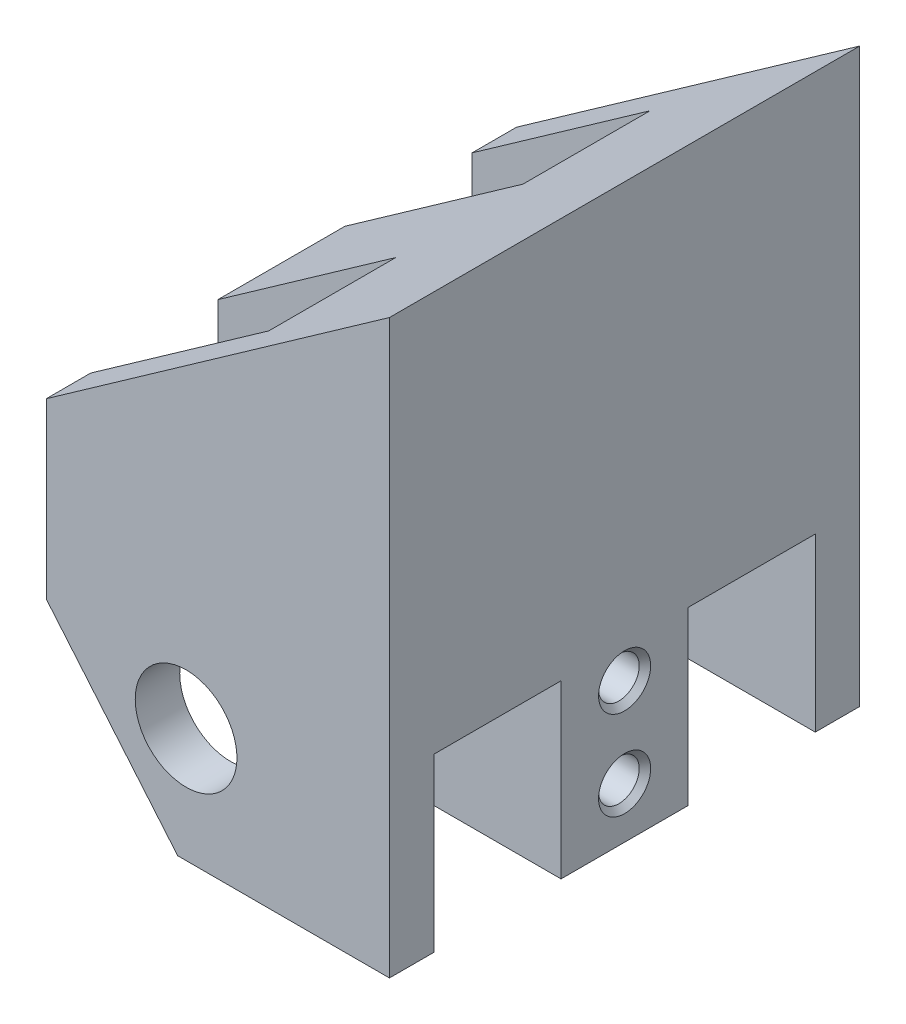
ISO-10303-21;
HEADER;
FILE_DESCRIPTION(('STEP AP214'),'2;1');
FILE_NAME('part.step','',(''),(''),'','','');
FILE_SCHEMA(('AUTOMOTIVE_DESIGN { 1 0 10303 214 1 1 1 1 }'));
ENDSEC;
DATA;
#1=APPLICATION_CONTEXT('core data for automotive mechanical design processes');
#2=APPLICATION_PROTOCOL_DEFINITION('international standard','automotive_design',2000,#1);
#3=PRODUCT_CONTEXT('',#1,'mechanical');
#4=PRODUCT('Part','Part','',(#3));
#5=PRODUCT_RELATED_PRODUCT_CATEGORY('part','',(#4));
#6=PRODUCT_DEFINITION_FORMATION('','',#4);
#7=PRODUCT_DEFINITION_CONTEXT('part definition',#1,'design');
#8=PRODUCT_DEFINITION('design','',#6,#7);
#9=PRODUCT_DEFINITION_SHAPE('','',#8);
#10=(LENGTH_UNIT() NAMED_UNIT(*) SI_UNIT(.MILLI.,.METRE.));
#11=(NAMED_UNIT(*) PLANE_ANGLE_UNIT() SI_UNIT($,.RADIAN.));
#12=(NAMED_UNIT(*) SI_UNIT($,.STERADIAN.) SOLID_ANGLE_UNIT());
#13=UNCERTAINTY_MEASURE_WITH_UNIT(LENGTH_MEASURE(1.E-05),#10,'distance_accuracy_value','');
#14=(GEOMETRIC_REPRESENTATION_CONTEXT(3) GLOBAL_UNCERTAINTY_ASSIGNED_CONTEXT((#13)) GLOBAL_UNIT_ASSIGNED_CONTEXT((#10,
#11,#12)) REPRESENTATION_CONTEXT('',''));
#15=CARTESIAN_POINT('',(0.,0.,0.));
#16=DIRECTION('',(0.,0.,1.));
#17=DIRECTION('',(1.,0.,0.));
#18=AXIS2_PLACEMENT_3D('',#15,#16,#17);
#19=CARTESIAN_POINT('',(-7.27644528508841,-10.5185988524712,18.5));
#20=DIRECTION('',(1.,0.,0.));
#21=DIRECTION('',(0.,0.,-1.));
#22=AXIS2_PLACEMENT_3D('',#19,#20,#21);
#23=PLANE('',#22);
#24=DIRECTION('',(0.,1.,0.));
#25=VECTOR('',#24,1.);
#26=CARTESIAN_POINT('',(-7.27644528508841,0.,11.75));
#27=LINE('',#26,#25);
#28=CARTESIAN_POINT('',(-7.27644528508841,-7.34221171131748,11.75));
#29=VERTEX_POINT('',#28);
#30=CARTESIAN_POINT('',(-7.27644528508841,-0.518598852471189,11.75));
#31=VERTEX_POINT('',#30);
#32=EDGE_CURVE('E317',#29,#31,#27,.T.);
#33=ORIENTED_EDGE('',*,*,#32,.T.);
#34=DIRECTION('',(0.,0.,-1.));
#35=VECTOR('',#34,1.);
#36=CARTESIAN_POINT('',(-7.27644528508841,-0.518598852471189,18.5));
#37=LINE('',#36,#35);
#38=CARTESIAN_POINT('',(-7.27644528508841,-0.51859885247119,6.75));
#39=VERTEX_POINT('',#38);
#40=EDGE_CURVE('E302',#31,#39,#37,.T.);
#41=ORIENTED_EDGE('',*,*,#40,.T.);
#42=DIRECTION('',(0.,1.,0.));
#43=VECTOR('',#42,1.);
#44=CARTESIAN_POINT('',(-7.27644528508841,0.,6.75));
#45=LINE('',#44,#43);
#46=CARTESIAN_POINT('',(-7.27644528508841,-7.34221171131747,6.75));
#47=VERTEX_POINT('',#46);
#48=EDGE_CURVE('E206',#47,#39,#45,.T.);
#49=ORIENTED_EDGE('',*,*,#48,.F.);
#50=DIRECTION('',(0.,0.,-1.));
#51=VECTOR('',#50,1.);
#52=CARTESIAN_POINT('',(-7.27644528508841,-7.34221171131748,18.5));
#53=LINE('',#52,#51);
#54=EDGE_CURVE('E250',#29,#47,#53,.T.);
#55=ORIENTED_EDGE('',*,*,#54,.F.);
#56=EDGE_LOOP('',(#33,#41,#49,#55));
#57=FACE_BOUND('',#56,.T.);
#58=ADVANCED_FACE('F37',(#57),#23,.F.);
#59=CARTESIAN_POINT('',(-7.27644528508841,-0.518598852471189,18.5));
#60=VERTEX_POINT('',#59);
#61=CARTESIAN_POINT('',(-7.27644528508841,-0.51859885247119,16.75));
#62=VERTEX_POINT('',#61);
#63=EDGE_CURVE('E298',#60,#62,#37,.T.);
#64=ORIENTED_EDGE('',*,*,#63,.T.);
#65=DIRECTION('',(0.,1.,0.));
#66=VECTOR('',#65,1.);
#67=CARTESIAN_POINT('',(-7.27644528508841,0.,16.75));
#68=LINE('',#67,#66);
#69=CARTESIAN_POINT('',(-7.27644528508841,-7.34221171131747,16.75));
#70=VERTEX_POINT('',#69);
#71=EDGE_CURVE('E201',#70,#62,#68,.T.);
#72=ORIENTED_EDGE('',*,*,#71,.F.);
#73=CARTESIAN_POINT('',(-7.27644528508841,-7.34221171131748,18.5));
#74=VERTEX_POINT('',#73);
#75=EDGE_CURVE('E246',#74,#70,#53,.T.);
#76=ORIENTED_EDGE('',*,*,#75,.F.);
#77=DIRECTION('',(0.,-1.,0.));
#78=VECTOR('',#77,1.);
#79=CARTESIAN_POINT('',(-7.27644528508841,-10.5185988524712,18.5));
#80=LINE('',#79,#78);
#81=EDGE_CURVE('E282',#60,#74,#80,.T.);
#82=ORIENTED_EDGE('',*,*,#81,.F.);
#83=EDGE_LOOP('',(#64,#72,#76,#82));
#84=FACE_BOUND('',#83,.T.);
#85=ADVANCED_FACE('F391',(#84),#23,.F.);
#86=DIRECTION('',(0.,1.,0.));
#87=VECTOR('',#86,1.);
#88=CARTESIAN_POINT('',(-7.27644528508841,0.,1.75));
#89=LINE('',#88,#87);
#90=CARTESIAN_POINT('',(-7.27644528508841,-7.34221171131748,1.74999999999999));
#91=VERTEX_POINT('',#90);
#92=CARTESIAN_POINT('',(-7.27644528508841,-0.51859885247119,1.75));
#93=VERTEX_POINT('',#92);
#94=EDGE_CURVE('E60',#91,#93,#89,.T.);
#95=ORIENTED_EDGE('',*,*,#94,.T.);
#96=CARTESIAN_POINT('',(-7.27644528508841,-0.518598852471189,0.));
#97=VERTEX_POINT('',#96);
#98=EDGE_CURVE('E297',#93,#97,#37,.T.);
#99=ORIENTED_EDGE('',*,*,#98,.T.);
#100=DIRECTION('',(0.,-1.,0.));
#101=VECTOR('',#100,1.);
#102=CARTESIAN_POINT('',(-7.27644528508841,-10.5185988524712,0.));
#103=LINE('',#102,#101);
#104=CARTESIAN_POINT('',(-7.27644528508841,-7.34221171131748,0.));
#105=VERTEX_POINT('',#104);
#106=EDGE_CURVE('E291',#97,#105,#103,.T.);
#107=ORIENTED_EDGE('',*,*,#106,.T.);
#108=EDGE_CURVE('E243',#91,#105,#53,.T.);
#109=ORIENTED_EDGE('',*,*,#108,.F.);
#110=EDGE_LOOP('',(#95,#99,#107,#109));
#111=FACE_BOUND('',#110,.T.);
#112=ADVANCED_FACE('F331',(#111),#23,.F.);
#113=CARTESIAN_POINT('',(6.22355471491159,-16.0034264097727,18.5));
#114=DIRECTION('',(-1.,0.,0.));
#115=DIRECTION('',(0.,-1.,0.));
#116=AXIS2_PLACEMENT_3D('',#113,#114,#115);
#117=PLANE('',#116);
#118=CARTESIAN_POINT('',(6.22355471491159,-8.00342640977265,9.25));
#119=DIRECTION('',(1.,0.,0.));
#120=DIRECTION('',(0.,0.,-1.));
#121=AXIS2_PLACEMENT_3D('',#118,#119,#120);
#122=CIRCLE('',#121,1.025);
#123=CARTESIAN_POINT('',(6.22355471491159,-8.00342640977265,8.225));
#124=VERTEX_POINT('',#123);
#125=EDGE_CURVE('E343',#124,#124,#122,.T.);
#126=ORIENTED_EDGE('',*,*,#125,.F.);
#127=EDGE_LOOP('',(#126));
#128=FACE_BOUND('',#127,.T.);
#129=CARTESIAN_POINT('',(6.22355471491159,-11.5034264097727,9.25));
#130=DIRECTION('',(1.,0.,0.));
#131=DIRECTION('',(0.,0.,-1.));
#132=AXIS2_PLACEMENT_3D('',#129,#130,#131);
#133=CIRCLE('',#132,1.025);
#134=CARTESIAN_POINT('',(6.22355471491159,-11.5034264097727,8.225));
#135=VERTEX_POINT('',#134);
#136=EDGE_CURVE('E357',#135,#135,#133,.T.);
#137=ORIENTED_EDGE('',*,*,#136,.F.);
#138=EDGE_LOOP('',(#137));
#139=FACE_BOUND('',#138,.T.);
#140=DIRECTION('',(0.,1.,0.));
#141=VECTOR('',#140,1.);
#142=CARTESIAN_POINT('',(6.22355471491159,0.,16.75));
#143=LINE('',#142,#141);
#144=CARTESIAN_POINT('',(6.22355471491159,-13.5034264097727,16.75));
#145=VERTEX_POINT('',#144);
#146=CARTESIAN_POINT('',(6.22355471491159,-6.75342640977265,16.75));
#147=VERTEX_POINT('',#146);
#148=EDGE_CURVE('E366',#145,#147,#143,.T.);
#149=ORIENTED_EDGE('',*,*,#148,.T.);
#150=DIRECTION('',(0.,0.,-1.));
#151=VECTOR('',#150,1.);
#152=CARTESIAN_POINT('',(6.22355471491159,-6.75342640977265,0.));
#153=LINE('',#152,#151);
#154=CARTESIAN_POINT('',(6.22355471491159,-6.75342640977265,11.75));
#155=VERTEX_POINT('',#154);
#156=EDGE_CURVE('E369',#147,#155,#153,.T.);
#157=ORIENTED_EDGE('',*,*,#156,.T.);
#158=DIRECTION('',(0.,1.,0.));
#159=VECTOR('',#158,1.);
#160=CARTESIAN_POINT('',(6.22355471491159,0.,11.75));
#161=LINE('',#160,#159);
#162=CARTESIAN_POINT('',(6.22355471491159,-13.5034264097727,11.75));
#163=VERTEX_POINT('',#162);
#164=EDGE_CURVE('E195',#163,#155,#161,.T.);
#165=ORIENTED_EDGE('',*,*,#164,.F.);
#166=DIRECTION('',(0.,0.,-1.));
#167=VECTOR('',#166,1.);
#168=CARTESIAN_POINT('',(6.22355471491159,-13.5034264097727,18.5));
#169=LINE('',#168,#167);
#170=CARTESIAN_POINT('',(6.22355471491159,-13.5034264097727,6.75));
#171=VERTEX_POINT('',#170);
#172=EDGE_CURVE('E261',#163,#171,#169,.T.);
#173=ORIENTED_EDGE('',*,*,#172,.T.);
#174=DIRECTION('',(0.,1.,0.));
#175=VECTOR('',#174,1.);
#176=CARTESIAN_POINT('',(6.22355471491159,0.,6.75));
#177=LINE('',#176,#175);
#178=CARTESIAN_POINT('',(6.22355471491159,-6.75342640977265,6.75));
#179=VERTEX_POINT('',#178);
#180=EDGE_CURVE('E207',#171,#179,#177,.T.);
#181=ORIENTED_EDGE('',*,*,#180,.T.);
#182=DIRECTION('',(0.,0.,1.));
#183=VECTOR('',#182,1.);
#184=CARTESIAN_POINT('',(6.22355471491159,-6.75342640977265,0.));
#185=LINE('',#184,#183);
#186=CARTESIAN_POINT('',(6.22355471491159,-6.75342640977265,1.75));
#187=VERTEX_POINT('',#186);
#188=EDGE_CURVE('E213',#187,#179,#185,.T.);
#189=ORIENTED_EDGE('',*,*,#188,.F.);
#190=DIRECTION('',(0.,1.,0.));
#191=VECTOR('',#190,1.);
#192=CARTESIAN_POINT('',(6.22355471491159,0.,1.75));
#193=LINE('',#192,#191);
#194=CARTESIAN_POINT('',(6.22355471491159,-13.5034264097727,1.74999999999999));
#195=VERTEX_POINT('',#194);
#196=EDGE_CURVE('E210',#195,#187,#193,.T.);
#197=ORIENTED_EDGE('',*,*,#196,.F.);
#198=CARTESIAN_POINT('',(6.22355471491159,-13.5034264097727,0.));
#199=VERTEX_POINT('',#198);
#200=EDGE_CURVE('E262',#195,#199,#169,.T.);
#201=ORIENTED_EDGE('',*,*,#200,.T.);
#202=DIRECTION('',(0.,1.,0.));
#203=VECTOR('',#202,1.);
#204=CARTESIAN_POINT('',(6.22355471491159,-16.0034264097727,0.));
#205=LINE('',#204,#203);
#206=CARTESIAN_POINT('',(6.22355471491159,8.99657359022735,0.));
#207=VERTEX_POINT('',#206);
#208=EDGE_CURVE('E283',#199,#207,#205,.T.);
#209=ORIENTED_EDGE('',*,*,#208,.T.);
#210=DIRECTION('',(0.,0.,-1.));
#211=VECTOR('',#210,1.);
#212=CARTESIAN_POINT('',(6.22355471491159,8.99657359022735,18.5));
#213=LINE('',#212,#211);
#214=CARTESIAN_POINT('',(6.22355471491159,8.99657359022735,18.5));
#215=VERTEX_POINT('',#214);
#216=EDGE_CURVE('E288',#215,#207,#213,.T.);
#217=ORIENTED_EDGE('',*,*,#216,.F.);
#218=DIRECTION('',(0.,1.,0.));
#219=VECTOR('',#218,1.);
#220=CARTESIAN_POINT('',(6.22355471491159,-16.0034264097727,18.5));
#221=LINE('',#220,#219);
#222=CARTESIAN_POINT('',(6.22355471491159,-13.5034264097727,18.5));
#223=VERTEX_POINT('',#222);
#224=EDGE_CURVE('E286',#223,#215,#221,.T.);
#225=ORIENTED_EDGE('',*,*,#224,.F.);
#226=EDGE_CURVE('E257',#223,#145,#169,.T.);
#227=ORIENTED_EDGE('',*,*,#226,.T.);
#228=EDGE_LOOP('',(#149,#157,#165,#173,#181,#189,#197,#201,#209,#217,#225,#227));
#229=FACE_BOUND('',#228,.T.);
#230=ADVANCED_FACE('F380',(#128,#139,#229),#117,.F.);
#231=CARTESIAN_POINT('',(-1.77644528508841,-9.00342640977265,18.5));
#232=DIRECTION('',(0.,0.,-1.));
#233=DIRECTION('',(-1.,0.,0.));
#234=AXIS2_PLACEMENT_3D('',#231,#232,#233);
#235=CYLINDRICAL_SURFACE('',#234,2.);
#236=CARTESIAN_POINT('',(-1.77644528508841,-9.00342640977265,18.5));
#237=DIRECTION('',(0.,0.,-1.));
#238=DIRECTION('',(-1.,0.,0.));
#239=AXIS2_PLACEMENT_3D('',#236,#237,#238);
#240=CIRCLE('',#239,2.);
#241=CARTESIAN_POINT('',(-3.77644528508841,-9.00342640977265,18.5));
#242=VERTEX_POINT('',#241);
#243=EDGE_CURVE('E273',#242,#242,#240,.T.);
#244=ORIENTED_EDGE('',*,*,#243,.F.);
#245=EDGE_LOOP('',(#244));
#246=FACE_BOUND('',#245,.T.);
#247=CARTESIAN_POINT('',(-1.77644528508841,-9.00342640977265,16.75));
#248=DIRECTION('',(0.,0.,-1.));
#249=DIRECTION('',(0.,1.,0.));
#250=AXIS2_PLACEMENT_3D('',#247,#248,#249);
#251=CIRCLE('',#250,2.);
#252=CARTESIAN_POINT('',(-1.77644528508841,-7.00342640977265,16.75));
#253=VERTEX_POINT('',#252);
#254=EDGE_CURVE('E236',#253,#253,#251,.F.);
#255=ORIENTED_EDGE('',*,*,#254,.F.);
#256=EDGE_LOOP('',(#255));
#257=FACE_BOUND('',#256,.T.);
#258=ADVANCED_FACE('F444',(#246,#257),#235,.F.);
#259=CARTESIAN_POINT('',(6.22355471491159,-13.5034264097727,18.5));
#260=DIRECTION('',(0.,1.,0.));
#261=DIRECTION('',(0.,0.,1.));
#262=AXIS2_PLACEMENT_3D('',#259,#260,#261);
#263=PLANE('',#262);
#264=DIRECTION('',(1.,0.,0.));
#265=VECTOR('',#264,1.);
#266=CARTESIAN_POINT('',(-7.27644528508841,-13.5034264097727,16.75));
#267=LINE('',#266,#265);
#268=CARTESIAN_POINT('',(-2.10657230401059,-13.5034264097727,16.75));
#269=VERTEX_POINT('',#268);
#270=EDGE_CURVE('E199',#269,#145,#267,.T.);
#271=ORIENTED_EDGE('',*,*,#270,.T.);
#272=ORIENTED_EDGE('',*,*,#226,.F.);
#273=DIRECTION('',(1.,0.,0.));
#274=VECTOR('',#273,1.);
#275=CARTESIAN_POINT('',(6.22355471491159,-13.5034264097727,18.5));
#276=LINE('',#275,#274);
#277=CARTESIAN_POINT('',(-2.10657230401058,-13.5034264097727,18.5));
#278=VERTEX_POINT('',#277);
#279=EDGE_CURVE('E251',#278,#223,#276,.T.);
#280=ORIENTED_EDGE('',*,*,#279,.F.);
#281=DIRECTION('',(0.,0.,-1.));
#282=VECTOR('',#281,1.);
#283=CARTESIAN_POINT('',(-2.10657230401058,-13.5034264097727,18.5));
#284=LINE('',#283,#282);
#285=EDGE_CURVE('E263',#278,#269,#284,.T.);
#286=ORIENTED_EDGE('',*,*,#285,.T.);
#287=EDGE_LOOP('',(#271,#272,#280,#286));
#288=FACE_BOUND('',#287,.T.);
#289=ADVANCED_FACE('F374',(#288),#263,.F.);
#290=ORIENTED_EDGE('',*,*,#172,.F.);
#291=DIRECTION('',(1.,0.,0.));
#292=VECTOR('',#291,1.);
#293=CARTESIAN_POINT('',(-7.27644528508841,-13.5034264097727,11.75));
#294=LINE('',#293,#292);
#295=CARTESIAN_POINT('',(-2.10657230401059,-13.5034264097727,11.75));
#296=VERTEX_POINT('',#295);
#297=EDGE_CURVE('E197',#296,#163,#294,.T.);
#298=ORIENTED_EDGE('',*,*,#297,.F.);
#299=CARTESIAN_POINT('',(-2.10657230401059,-13.5034264097727,6.75));
#300=VERTEX_POINT('',#299);
#301=EDGE_CURVE('E266',#296,#300,#284,.T.);
#302=ORIENTED_EDGE('',*,*,#301,.T.);
#303=DIRECTION('',(1.,0.,0.));
#304=VECTOR('',#303,1.);
#305=CARTESIAN_POINT('',(-7.27644528508841,-13.5034264097727,6.75));
#306=LINE('',#305,#304);
#307=EDGE_CURVE('E219',#300,#171,#306,.T.);
#308=ORIENTED_EDGE('',*,*,#307,.T.);
#309=EDGE_LOOP('',(#290,#298,#302,#308));
#310=FACE_BOUND('',#309,.T.);
#311=ADVANCED_FACE('F415',(#310),#263,.F.);
#312=CARTESIAN_POINT('',(-2.10657230401058,-13.5034264097727,18.5));
#313=DIRECTION('',(0.766044443118975,0.642787609686543,0.));
#314=DIRECTION('',(-0.642787609686543,0.766044443118975,0.));
#315=AXIS2_PLACEMENT_3D('',#312,#313,#314);
#316=PLANE('',#315);
#317=DIRECTION('',(-0.642787609686543,0.766044443118975,0.));
#318=VECTOR('',#317,1.);
#319=CARTESIAN_POINT('',(-2.10657230401058,-13.5034264097727,16.75));
#320=LINE('',#319,#318);
#321=EDGE_CURVE('E11',#269,#70,#320,.T.);
#322=ORIENTED_EDGE('',*,*,#321,.F.);
#323=ORIENTED_EDGE('',*,*,#285,.F.);
#324=DIRECTION('',(0.642787609686543,-0.766044443118975,0.));
#325=VECTOR('',#324,1.);
#326=CARTESIAN_POINT('',(-2.10657230401058,-13.5034264097727,18.5));
#327=LINE('',#326,#325);
#328=EDGE_CURVE('E240',#74,#278,#327,.T.);
#329=ORIENTED_EDGE('',*,*,#328,.F.);
#330=ORIENTED_EDGE('',*,*,#75,.T.);
#331=EDGE_LOOP('',(#322,#323,#329,#330));
#332=FACE_BOUND('',#331,.T.);
#333=ADVANCED_FACE('F388',(#332),#316,.F.);
#334=ORIENTED_EDGE('',*,*,#301,.F.);
#335=DIRECTION('',(-0.642787609686543,0.766044443118975,0.));
#336=VECTOR('',#335,1.);
#337=CARTESIAN_POINT('',(-2.10657230401058,-13.5034264097727,11.75));
#338=LINE('',#337,#336);
#339=EDGE_CURVE('E45',#296,#29,#338,.T.);
#340=ORIENTED_EDGE('',*,*,#339,.T.);
#341=ORIENTED_EDGE('',*,*,#54,.T.);
#342=DIRECTION('',(-0.642787609686543,0.766044443118975,0.));
#343=VECTOR('',#342,1.);
#344=CARTESIAN_POINT('',(-2.10657230401058,-13.5034264097727,6.75));
#345=LINE('',#344,#343);
#346=EDGE_CURVE('E304',#300,#47,#345,.T.);
#347=ORIENTED_EDGE('',*,*,#346,.F.);
#348=EDGE_LOOP('',(#334,#340,#341,#347));
#349=FACE_BOUND('',#348,.T.);
#350=ADVANCED_FACE('F310',(#349),#316,.F.);
#351=CARTESIAN_POINT('',(-7.27644528508841,-0.518598852471189,18.5));
#352=DIRECTION('',(0.576107632870787,-0.81737384063109,0.));
#353=DIRECTION('',(0.81737384063109,0.576107632870787,0.));
#354=AXIS2_PLACEMENT_3D('',#351,#352,#353);
#355=PLANE('',#354);
#356=ORIENTED_EDGE('',*,*,#40,.F.);
#357=DIRECTION('',(0.81737384063109,0.576107632870787,0.));
#358=VECTOR('',#357,1.);
#359=CARTESIAN_POINT('',(-7.27644528508841,-0.51859885247119,11.75));
#360=LINE('',#359,#358);
#361=CARTESIAN_POINT('',(-0.27644528508841,4.41519426596509,11.75));
#362=VERTEX_POINT('',#361);
#363=EDGE_CURVE('E337',#31,#362,#360,.T.);
#364=ORIENTED_EDGE('',*,*,#363,.T.);
#365=DIRECTION('',(0.,0.,1.));
#366=VECTOR('',#365,1.);
#367=CARTESIAN_POINT('',(-0.276445285088412,4.41519426596509,18.5));
#368=LINE('',#367,#366);
#369=CARTESIAN_POINT('',(-0.276445285088412,4.41519426596509,16.75));
#370=VERTEX_POINT('',#369);
#371=EDGE_CURVE('E175',#362,#370,#368,.T.);
#372=ORIENTED_EDGE('',*,*,#371,.T.);
#373=DIRECTION('',(-0.81737384063109,-0.576107632870787,0.));
#374=VECTOR('',#373,1.);
#375=CARTESIAN_POINT('',(-7.27644528508841,-0.518598852471189,16.75));
#376=LINE('',#375,#374);
#377=EDGE_CURVE('E180',#370,#62,#376,.T.);
#378=ORIENTED_EDGE('',*,*,#377,.T.);
#379=ORIENTED_EDGE('',*,*,#63,.F.);
#380=DIRECTION('',(-0.81737384063109,-0.576107632870787,0.));
#381=VECTOR('',#380,1.);
#382=CARTESIAN_POINT('',(-7.27644528508841,-0.518598852471189,18.5));
#383=LINE('',#382,#381);
#384=EDGE_CURVE('E279',#215,#60,#383,.T.);
#385=ORIENTED_EDGE('',*,*,#384,.F.);
#386=ORIENTED_EDGE('',*,*,#216,.T.);
#387=DIRECTION('',(-0.81737384063109,-0.576107632870787,0.));
#388=VECTOR('',#387,1.);
#389=CARTESIAN_POINT('',(-7.27644528508841,-0.518598852471189,0.));
#390=LINE('',#389,#388);
#391=EDGE_CURVE('E276',#207,#97,#390,.T.);
#392=ORIENTED_EDGE('',*,*,#391,.T.);
#393=ORIENTED_EDGE('',*,*,#98,.F.);
#394=DIRECTION('',(0.81737384063109,0.576107632870787,0.));
#395=VECTOR('',#394,1.);
#396=CARTESIAN_POINT('',(-7.27644528508842,-0.518598852471194,1.75));
#397=LINE('',#396,#395);
#398=CARTESIAN_POINT('',(-0.27644528508841,4.41519426596509,1.74999999999999));
#399=VERTEX_POINT('',#398);
#400=EDGE_CURVE('E348',#93,#399,#397,.T.);
#401=ORIENTED_EDGE('',*,*,#400,.T.);
#402=DIRECTION('',(0.,0.,1.));
#403=VECTOR('',#402,1.);
#404=CARTESIAN_POINT('',(-0.276445285088409,4.41519426596509,18.5));
#405=LINE('',#404,#403);
#406=CARTESIAN_POINT('',(-0.27644528508841,4.41519426596509,6.75));
#407=VERTEX_POINT('',#406);
#408=EDGE_CURVE('E340',#399,#407,#405,.T.);
#409=ORIENTED_EDGE('',*,*,#408,.T.);
#410=DIRECTION('',(-0.81737384063109,-0.576107632870787,0.));
#411=VECTOR('',#410,1.);
#412=CARTESIAN_POINT('',(-7.27644528508841,-0.518598852471188,6.75));
#413=LINE('',#412,#411);
#414=EDGE_CURVE('E339',#407,#39,#413,.T.);
#415=ORIENTED_EDGE('',*,*,#414,.T.);
#416=EDGE_LOOP('',(#356,#364,#372,#378,#379,#385,#386,#392,#393,#401,#409,#415));
#417=FACE_BOUND('',#416,.T.);
#418=ADVANCED_FACE('F39',(#417),#355,.F.);
#419=CARTESIAN_POINT('',(0.,0.,18.5));
#420=DIRECTION('',(0.,0.,-1.));
#421=DIRECTION('',(-1.,0.,0.));
#422=AXIS2_PLACEMENT_3D('',#419,#420,#421);
#423=PLANE('',#422);
#424=ORIENTED_EDGE('',*,*,#243,.T.);
#425=EDGE_LOOP('',(#424));
#426=FACE_BOUND('',#425,.T.);
#427=ORIENTED_EDGE('',*,*,#81,.T.);
#428=ORIENTED_EDGE('',*,*,#328,.T.);
#429=ORIENTED_EDGE('',*,*,#279,.T.);
#430=ORIENTED_EDGE('',*,*,#224,.T.);
#431=ORIENTED_EDGE('',*,*,#384,.T.);
#432=EDGE_LOOP('',(#427,#428,#429,#430,#431));
#433=FACE_BOUND('',#432,.T.);
#434=ADVANCED_FACE('F384',(#426,#433),#423,.F.);
#435=CARTESIAN_POINT('',(0.,0.,0.));
#436=DIRECTION('',(0.,0.,-1.));
#437=DIRECTION('',(-1.,0.,0.));
#438=AXIS2_PLACEMENT_3D('',#435,#436,#437);
#439=PLANE('',#438);
#440=DIRECTION('',(0.642787609686543,-0.766044443118975,0.));
#441=VECTOR('',#440,1.);
#442=CARTESIAN_POINT('',(-2.10657230401058,-13.5034264097727,0.));
#443=LINE('',#442,#441);
#444=CARTESIAN_POINT('',(-2.10657230401058,-13.5034264097727,0.));
#445=VERTEX_POINT('',#444);
#446=EDGE_CURVE('E239',#105,#445,#443,.T.);
#447=ORIENTED_EDGE('',*,*,#446,.F.);
#448=ORIENTED_EDGE('',*,*,#106,.F.);
#449=ORIENTED_EDGE('',*,*,#391,.F.);
#450=ORIENTED_EDGE('',*,*,#208,.F.);
#451=DIRECTION('',(1.,0.,0.));
#452=VECTOR('',#451,1.);
#453=CARTESIAN_POINT('',(6.22355471491159,-13.5034264097727,0.));
#454=LINE('',#453,#452);
#455=EDGE_CURVE('E249',#445,#199,#454,.T.);
#456=ORIENTED_EDGE('',*,*,#455,.F.);
#457=EDGE_LOOP('',(#447,#448,#449,#450,#456));
#458=FACE_BOUND('',#457,.T.);
#459=CARTESIAN_POINT('',(2.22355471491159,-5.00342640977265,0.));
#460=DIRECTION('',(0.,0.,-1.));
#461=DIRECTION('',(-1.,0.,0.));
#462=AXIS2_PLACEMENT_3D('',#459,#460,#461);
#463=CIRCLE('',#462,1.5);
#464=CARTESIAN_POINT('',(0.723554714911593,-5.00342640977265,0.));
#465=VERTEX_POINT('',#464);
#466=EDGE_CURVE('E260',#465,#465,#463,.T.);
#467=ORIENTED_EDGE('',*,*,#466,.F.);
#468=EDGE_LOOP('',(#467));
#469=FACE_BOUND('',#468,.T.);
#470=CARTESIAN_POINT('',(-1.77644528508841,-9.00342640977265,0.));
#471=DIRECTION('',(0.,0.,-1.));
#472=DIRECTION('',(-1.,0.,0.));
#473=AXIS2_PLACEMENT_3D('',#470,#471,#472);
#474=CIRCLE('',#473,2.);
#475=CARTESIAN_POINT('',(-3.77644528508841,-9.00342640977265,0.));
#476=VERTEX_POINT('',#475);
#477=EDGE_CURVE('E270',#476,#476,#474,.T.);
#478=ORIENTED_EDGE('',*,*,#477,.F.);
#479=EDGE_LOOP('',(#478));
#480=FACE_BOUND('',#479,.T.);
#481=ADVANCED_FACE('F327',(#458,#469,#480),#439,.T.);
#482=CARTESIAN_POINT('',(-1.77644528508841,-9.00342640977265,1.75));
#483=DIRECTION('',(0.,0.,-1.));
#484=DIRECTION('',(0.,1.,0.));
#485=AXIS2_PLACEMENT_3D('',#482,#483,#484);
#486=CIRCLE('',#485,2.);
#487=CARTESIAN_POINT('',(-1.77644528508841,-7.00342640977265,1.75));
#488=VERTEX_POINT('',#487);
#489=EDGE_CURVE('E227',#488,#488,#486,.F.);
#490=ORIENTED_EDGE('',*,*,#489,.T.);
#491=EDGE_LOOP('',(#490));
#492=FACE_BOUND('',#491,.T.);
#493=ORIENTED_EDGE('',*,*,#477,.T.);
#494=EDGE_LOOP('',(#493));
#495=FACE_BOUND('',#494,.T.);
#496=ADVANCED_FACE('F452',(#492,#495),#235,.F.);
#497=CARTESIAN_POINT('',(2.22355471491159,-5.00342640977265,11.));
#498=DIRECTION('',(0.,0.,-1.));
#499=DIRECTION('',(-1.,0.,0.));
#500=AXIS2_PLACEMENT_3D('',#497,#498,#499);
#501=CYLINDRICAL_SURFACE('',#500,1.5);
#502=CARTESIAN_POINT('',(2.22355471491159,-5.00342640977265,11.));
#503=DIRECTION('',(0.,0.,-1.));
#504=DIRECTION('',(-1.,0.,0.));
#505=AXIS2_PLACEMENT_3D('',#502,#503,#504);
#506=CIRCLE('',#505,1.5);
#507=CARTESIAN_POINT('',(0.723554714911593,-5.00342640977265,11.));
#508=VERTEX_POINT('',#507);
#509=EDGE_CURVE('E267',#508,#508,#506,.T.);
#510=ORIENTED_EDGE('',*,*,#509,.F.);
#511=EDGE_LOOP('',(#510));
#512=FACE_BOUND('',#511,.T.);
#513=ORIENTED_EDGE('',*,*,#466,.T.);
#514=EDGE_LOOP('',(#513));
#515=FACE_BOUND('',#514,.T.);
#516=ADVANCED_FACE('F462',(#512,#515),#501,.F.);
#517=CARTESIAN_POINT('',(0.,0.,11.));
#518=DIRECTION('',(0.,0.,-1.));
#519=DIRECTION('',(-1.,0.,0.));
#520=AXIS2_PLACEMENT_3D('',#517,#518,#519);
#521=PLANE('',#520);
#522=ORIENTED_EDGE('',*,*,#509,.T.);
#523=EDGE_LOOP('',(#522));
#524=FACE_BOUND('',#523,.T.);
#525=ADVANCED_FACE('F466',(#524),#521,.T.);
#526=ORIENTED_EDGE('',*,*,#200,.F.);
#527=DIRECTION('',(1.,0.,0.));
#528=VECTOR('',#527,1.);
#529=CARTESIAN_POINT('',(-7.27644528508841,-13.5034264097727,1.74999999999999));
#530=LINE('',#529,#528);
#531=CARTESIAN_POINT('',(-2.10657230401059,-13.5034264097727,1.74999999999999));
#532=VERTEX_POINT('',#531);
#533=EDGE_CURVE('E209',#532,#195,#530,.T.);
#534=ORIENTED_EDGE('',*,*,#533,.F.);
#535=EDGE_CURVE('E254',#532,#445,#284,.T.);
#536=ORIENTED_EDGE('',*,*,#535,.T.);
#537=ORIENTED_EDGE('',*,*,#455,.T.);
#538=EDGE_LOOP('',(#526,#534,#536,#537));
#539=FACE_BOUND('',#538,.T.);
#540=ADVANCED_FACE('F421',(#539),#263,.F.);
#541=ORIENTED_EDGE('',*,*,#535,.F.);
#542=DIRECTION('',(-0.642787609686543,0.766044443118975,0.));
#543=VECTOR('',#542,1.);
#544=CARTESIAN_POINT('',(-2.10657230401059,-13.5034264097726,1.74999999999999));
#545=LINE('',#544,#543);
#546=EDGE_CURVE('E301',#532,#91,#545,.T.);
#547=ORIENTED_EDGE('',*,*,#546,.T.);
#548=ORIENTED_EDGE('',*,*,#108,.T.);
#549=ORIENTED_EDGE('',*,*,#446,.T.);
#550=EDGE_LOOP('',(#541,#547,#548,#549));
#551=FACE_BOUND('',#550,.T.);
#552=ADVANCED_FACE('F322',(#551),#316,.F.);
#553=CARTESIAN_POINT('',(-7.27644528508841,0.,6.75));
#554=DIRECTION('',(0.,0.,-1.));
#555=DIRECTION('',(0.,1.,0.));
#556=AXIS2_PLACEMENT_3D('',#553,#554,#555);
#557=PLANE('',#556);
#558=ORIENTED_EDGE('',*,*,#346,.T.);
#559=ORIENTED_EDGE('',*,*,#48,.T.);
#560=ORIENTED_EDGE('',*,*,#414,.F.);
#561=DIRECTION('',(0.,-1.,0.));
#562=VECTOR('',#561,1.);
#563=CARTESIAN_POINT('',(-0.276445285088411,8.99657359022735,6.75));
#564=LINE('',#563,#562);
#565=CARTESIAN_POINT('',(-0.276445285088409,-6.75342640977265,6.75));
#566=VERTEX_POINT('',#565);
#567=EDGE_CURVE('E190',#407,#566,#564,.T.);
#568=ORIENTED_EDGE('',*,*,#567,.T.);
#569=DIRECTION('',(1.,0.,0.));
#570=VECTOR('',#569,1.);
#571=CARTESIAN_POINT('',(-7.27644528508841,-6.75342640977265,6.75));
#572=LINE('',#571,#570);
#573=EDGE_CURVE('E222',#566,#179,#572,.T.);
#574=ORIENTED_EDGE('',*,*,#573,.T.);
#575=ORIENTED_EDGE('',*,*,#180,.F.);
#576=ORIENTED_EDGE('',*,*,#307,.F.);
#577=EDGE_LOOP('',(#558,#559,#560,#568,#574,#575,#576));
#578=FACE_BOUND('',#577,.T.);
#579=CARTESIAN_POINT('',(-1.77644528508841,-9.00342640977265,6.75));
#580=DIRECTION('',(0.,0.,-1.));
#581=DIRECTION('',(0.,1.,0.));
#582=AXIS2_PLACEMENT_3D('',#579,#580,#581);
#583=CIRCLE('',#582,2.);
#584=CARTESIAN_POINT('',(-1.77644528508841,-7.00342640977265,6.75));
#585=VERTEX_POINT('',#584);
#586=EDGE_CURVE('E230',#585,#585,#583,.F.);
#587=ORIENTED_EDGE('',*,*,#586,.T.);
#588=EDGE_LOOP('',(#587));
#589=FACE_BOUND('',#588,.T.);
#590=ADVANCED_FACE('F424',(#578,#589),#557,.T.);
#591=CARTESIAN_POINT('',(-7.27644528508841,0.,1.75));
#592=DIRECTION('',(0.,0.,-1.));
#593=DIRECTION('',(0.,1.,0.));
#594=AXIS2_PLACEMENT_3D('',#591,#592,#593);
#595=PLANE('',#594);
#596=ORIENTED_EDGE('',*,*,#533,.T.);
#597=ORIENTED_EDGE('',*,*,#196,.T.);
#598=DIRECTION('',(1.,0.,0.));
#599=VECTOR('',#598,1.);
#600=CARTESIAN_POINT('',(-7.27644528508841,-6.75342640977265,1.75));
#601=LINE('',#600,#599);
#602=CARTESIAN_POINT('',(-0.276445285088409,-6.75342640977265,1.74999999999999));
#603=VERTEX_POINT('',#602);
#604=EDGE_CURVE('E224',#603,#187,#601,.T.);
#605=ORIENTED_EDGE('',*,*,#604,.F.);
#606=DIRECTION('',(0.,-1.,0.));
#607=VECTOR('',#606,1.);
#608=CARTESIAN_POINT('',(-0.276445285088411,8.99657359022735,1.74999999999999));
#609=LINE('',#608,#607);
#610=EDGE_CURVE('E398',#399,#603,#609,.T.);
#611=ORIENTED_EDGE('',*,*,#610,.F.);
#612=ORIENTED_EDGE('',*,*,#400,.F.);
#613=ORIENTED_EDGE('',*,*,#94,.F.);
#614=ORIENTED_EDGE('',*,*,#546,.F.);
#615=EDGE_LOOP('',(#596,#597,#605,#611,#612,#613,#614));
#616=FACE_BOUND('',#615,.T.);
#617=ORIENTED_EDGE('',*,*,#489,.F.);
#618=EDGE_LOOP('',(#617));
#619=FACE_BOUND('',#618,.T.);
#620=ADVANCED_FACE('F402',(#616,#619),#595,.F.);
#621=CARTESIAN_POINT('',(-7.27644528508841,-6.75342640977265,0.));
#622=DIRECTION('',(0.,1.,0.));
#623=DIRECTION('',(0.,0.,1.));
#624=AXIS2_PLACEMENT_3D('',#621,#622,#623);
#625=PLANE('',#624);
#626=ORIENTED_EDGE('',*,*,#573,.F.);
#627=DIRECTION('',(0.,0.,1.));
#628=VECTOR('',#627,1.);
#629=CARTESIAN_POINT('',(-0.276445285088409,-6.75342640977265,1.74999999999999));
#630=LINE('',#629,#628);
#631=EDGE_CURVE('E408',#603,#566,#630,.T.);
#632=ORIENTED_EDGE('',*,*,#631,.F.);
#633=ORIENTED_EDGE('',*,*,#604,.T.);
#634=ORIENTED_EDGE('',*,*,#188,.T.);
#635=EDGE_LOOP('',(#626,#632,#633,#634));
#636=FACE_BOUND('',#635,.T.);
#637=ADVANCED_FACE('F423',(#636),#625,.F.);
#638=CARTESIAN_POINT('',(-7.27644528508841,0.,16.75));
#639=DIRECTION('',(0.,0.,-1.));
#640=DIRECTION('',(0.,1.,0.));
#641=AXIS2_PLACEMENT_3D('',#638,#639,#640);
#642=PLANE('',#641);
#643=ORIENTED_EDGE('',*,*,#321,.T.);
#644=ORIENTED_EDGE('',*,*,#71,.T.);
#645=ORIENTED_EDGE('',*,*,#377,.F.);
#646=DIRECTION('',(0.,-1.,0.));
#647=VECTOR('',#646,1.);
#648=CARTESIAN_POINT('',(-0.276445285088412,8.99657359022735,16.75));
#649=LINE('',#648,#647);
#650=CARTESIAN_POINT('',(-0.27644528508841,-6.75342640977265,16.75));
#651=VERTEX_POINT('',#650);
#652=EDGE_CURVE('E181',#370,#651,#649,.T.);
#653=ORIENTED_EDGE('',*,*,#652,.T.);
#654=DIRECTION('',(1.,0.,0.));
#655=VECTOR('',#654,1.);
#656=CARTESIAN_POINT('',(-7.27644528508841,-6.75342640977265,16.75));
#657=LINE('',#656,#655);
#658=EDGE_CURVE('E189',#651,#147,#657,.T.);
#659=ORIENTED_EDGE('',*,*,#658,.T.);
#660=ORIENTED_EDGE('',*,*,#148,.F.);
#661=ORIENTED_EDGE('',*,*,#270,.F.);
#662=EDGE_LOOP('',(#643,#644,#645,#653,#659,#660,#661));
#663=FACE_BOUND('',#662,.T.);
#664=ORIENTED_EDGE('',*,*,#254,.T.);
#665=EDGE_LOOP('',(#664));
#666=FACE_BOUND('',#665,.T.);
#667=ADVANCED_FACE('F393',(#663,#666),#642,.T.);
#668=CARTESIAN_POINT('',(-7.27644528508841,0.,11.75));
#669=DIRECTION('',(0.,0.,-1.));
#670=DIRECTION('',(-1.,0.,0.));
#671=AXIS2_PLACEMENT_3D('',#668,#669,#670);
#672=PLANE('',#671);
#673=ORIENTED_EDGE('',*,*,#297,.T.);
#674=ORIENTED_EDGE('',*,*,#164,.T.);
#675=DIRECTION('',(1.,0.,0.));
#676=VECTOR('',#675,1.);
#677=CARTESIAN_POINT('',(-7.27644528508841,-6.75342640977265,11.75));
#678=LINE('',#677,#676);
#679=CARTESIAN_POINT('',(-0.27644528508841,-6.75342640977265,11.75));
#680=VERTEX_POINT('',#679);
#681=EDGE_CURVE('E187',#680,#155,#678,.T.);
#682=ORIENTED_EDGE('',*,*,#681,.F.);
#683=DIRECTION('',(0.,-1.,0.));
#684=VECTOR('',#683,1.);
#685=CARTESIAN_POINT('',(-0.276445285088411,8.99657359022735,11.75));
#686=LINE('',#685,#684);
#687=EDGE_CURVE('E172',#362,#680,#686,.T.);
#688=ORIENTED_EDGE('',*,*,#687,.F.);
#689=ORIENTED_EDGE('',*,*,#363,.F.);
#690=ORIENTED_EDGE('',*,*,#32,.F.);
#691=ORIENTED_EDGE('',*,*,#339,.F.);
#692=EDGE_LOOP('',(#673,#674,#682,#688,#689,#690,#691));
#693=FACE_BOUND('',#692,.T.);
#694=CARTESIAN_POINT('',(-1.77644528508841,-9.00342640977265,11.75));
#695=DIRECTION('',(0.,0.,-1.));
#696=DIRECTION('',(-1.,0.,0.));
#697=AXIS2_PLACEMENT_3D('',#694,#695,#696);
#698=CIRCLE('',#697,2.);
#699=CARTESIAN_POINT('',(-3.77644528508841,-9.00342640977265,11.75));
#700=VERTEX_POINT('',#699);
#701=EDGE_CURVE('E233',#700,#700,#698,.F.);
#702=ORIENTED_EDGE('',*,*,#701,.F.);
#703=EDGE_LOOP('',(#702));
#704=FACE_BOUND('',#703,.T.);
#705=ADVANCED_FACE('F192',(#693,#704),#672,.F.);
#706=CARTESIAN_POINT('',(-7.27644528508841,-6.75342640977265,0.));
#707=DIRECTION('',(0.,-1.,0.));
#708=DIRECTION('',(1.,0.,0.));
#709=AXIS2_PLACEMENT_3D('',#706,#707,#708);
#710=PLANE('',#709);
#711=DIRECTION('',(0.,0.,1.));
#712=VECTOR('',#711,1.);
#713=CARTESIAN_POINT('',(-0.276445285088411,-6.75342640977265,16.75));
#714=LINE('',#713,#712);
#715=EDGE_CURVE('E52',#680,#651,#714,.T.);
#716=ORIENTED_EDGE('',*,*,#715,.F.);
#717=ORIENTED_EDGE('',*,*,#681,.T.);
#718=ORIENTED_EDGE('',*,*,#156,.F.);
#719=ORIENTED_EDGE('',*,*,#658,.F.);
#720=EDGE_LOOP('',(#716,#717,#718,#719));
#721=FACE_BOUND('',#720,.T.);
#722=ADVANCED_FACE('F185',(#721),#710,.T.);
#723=ORIENTED_EDGE('',*,*,#701,.T.);
#724=EDGE_LOOP('',(#723));
#725=FACE_BOUND('',#724,.T.);
#726=ORIENTED_EDGE('',*,*,#586,.F.);
#727=EDGE_LOOP('',(#726));
#728=FACE_BOUND('',#727,.T.);
#729=ADVANCED_FACE('F451',(#725,#728),#235,.F.);
#730=CARTESIAN_POINT('',(1.22355471491159,-11.5034264097727,9.25));
#731=DIRECTION('',(1.,0.,0.));
#732=DIRECTION('',(0.,0.,-1.));
#733=AXIS2_PLACEMENT_3D('',#730,#731,#732);
#734=CONICAL_SURFACE('',#733,0.799999999999999,1.02974425867665);
#735=CARTESIAN_POINT('',(0.742866219689543,-11.5034264097727,9.25));
#736=VERTEX_POINT('',#735);
#737=VERTEX_LOOP('',#736);
#738=FACE_BOUND('',#737,.T.);
#739=CARTESIAN_POINT('',(1.22355471491159,-11.5034264097727,9.25));
#740=DIRECTION('',(1.,0.,0.));
#741=DIRECTION('',(0.,0.,-1.));
#742=AXIS2_PLACEMENT_3D('',#739,#740,#741);
#743=CIRCLE('',#742,0.799999999999999);
#744=CARTESIAN_POINT('',(1.22355471491159,-11.5034264097727,8.45));
#745=VERTEX_POINT('',#744);
#746=EDGE_CURVE('E214',#745,#745,#743,.T.);
#747=ORIENTED_EDGE('',*,*,#746,.T.);
#748=EDGE_LOOP('',(#747));
#749=FACE_BOUND('',#748,.T.);
#750=ADVANCED_FACE('F487',(#738,#749),#734,.F.);
#751=CARTESIAN_POINT('',(6.22355471491159,-11.5034264097727,9.25));
#752=DIRECTION('',(1.,0.,0.));
#753=DIRECTION('',(0.,0.,-1.));
#754=AXIS2_PLACEMENT_3D('',#751,#752,#753);
#755=CYLINDRICAL_SURFACE('',#754,0.799999999999999);
#756=ORIENTED_EDGE('',*,*,#746,.F.);
#757=EDGE_LOOP('',(#756));
#758=FACE_BOUND('',#757,.T.);
#759=CARTESIAN_POINT('',(5.99855471491159,-11.5034264097727,9.25));
#760=DIRECTION('',(1.,0.,0.));
#761=DIRECTION('',(0.,0.,-1.));
#762=AXIS2_PLACEMENT_3D('',#759,#760,#761);
#763=CIRCLE('',#762,0.799999999999999);
#764=CARTESIAN_POINT('',(5.99855471491159,-11.5034264097727,8.45));
#765=VERTEX_POINT('',#764);
#766=EDGE_CURVE('E360',#765,#765,#763,.T.);
#767=ORIENTED_EDGE('',*,*,#766,.T.);
#768=EDGE_LOOP('',(#767));
#769=FACE_BOUND('',#768,.T.);
#770=ADVANCED_FACE('F490',(#758,#769),#755,.F.);
#771=CARTESIAN_POINT('',(6.22355471491159,-11.5034264097727,9.25));
#772=DIRECTION('',(1.,0.,0.));
#773=DIRECTION('',(0.,0.,-1.));
#774=AXIS2_PLACEMENT_3D('',#771,#772,#773);
#775=CONICAL_SURFACE('',#774,1.025,0.785398163397446);
#776=ORIENTED_EDGE('',*,*,#766,.F.);
#777=EDGE_LOOP('',(#776));
#778=FACE_BOUND('',#777,.T.);
#779=ORIENTED_EDGE('',*,*,#136,.T.);
#780=EDGE_LOOP('',(#779));
#781=FACE_BOUND('',#780,.T.);
#782=ADVANCED_FACE('F494',(#778,#781),#775,.F.);
#783=CARTESIAN_POINT('',(1.22355471491159,-8.00342640977265,9.25));
#784=DIRECTION('',(1.,0.,0.));
#785=DIRECTION('',(0.,0.,-1.));
#786=AXIS2_PLACEMENT_3D('',#783,#784,#785);
#787=CONICAL_SURFACE('',#786,0.799999999999999,1.02974425867665);
#788=CARTESIAN_POINT('',(0.742866219689543,-8.00342640977265,9.25));
#789=VERTEX_POINT('',#788);
#790=VERTEX_LOOP('',#789);
#791=FACE_BOUND('',#790,.T.);
#792=CARTESIAN_POINT('',(1.22355471491159,-8.00342640977265,9.25));
#793=DIRECTION('',(1.,0.,0.));
#794=DIRECTION('',(0.,0.,-1.));
#795=AXIS2_PLACEMENT_3D('',#792,#793,#794);
#796=CIRCLE('',#795,0.799999999999999);
#797=CARTESIAN_POINT('',(1.22355471491159,-8.00342640977265,8.45));
#798=VERTEX_POINT('',#797);
#799=EDGE_CURVE('E354',#798,#798,#796,.T.);
#800=ORIENTED_EDGE('',*,*,#799,.T.);
#801=EDGE_LOOP('',(#800));
#802=FACE_BOUND('',#801,.T.);
#803=ADVANCED_FACE('F498',(#791,#802),#787,.F.);
#804=CARTESIAN_POINT('',(6.22355471491159,-8.00342640977265,9.25));
#805=DIRECTION('',(1.,0.,0.));
#806=DIRECTION('',(0.,0.,-1.));
#807=AXIS2_PLACEMENT_3D('',#804,#805,#806);
#808=CYLINDRICAL_SURFACE('',#807,0.799999999999999);
#809=ORIENTED_EDGE('',*,*,#799,.F.);
#810=EDGE_LOOP('',(#809));
#811=FACE_BOUND('',#810,.T.);
#812=CARTESIAN_POINT('',(5.99855471491159,-8.00342640977265,9.25));
#813=DIRECTION('',(1.,0.,0.));
#814=DIRECTION('',(0.,0.,-1.));
#815=AXIS2_PLACEMENT_3D('',#812,#813,#814);
#816=CIRCLE('',#815,0.799999999999999);
#817=CARTESIAN_POINT('',(5.99855471491159,-8.00342640977265,8.45));
#818=VERTEX_POINT('',#817);
#819=EDGE_CURVE('E346',#818,#818,#816,.T.);
#820=ORIENTED_EDGE('',*,*,#819,.T.);
#821=EDGE_LOOP('',(#820));
#822=FACE_BOUND('',#821,.T.);
#823=ADVANCED_FACE('F502',(#811,#822),#808,.F.);
#824=CARTESIAN_POINT('',(6.22355471491159,-8.00342640977265,9.25));
#825=DIRECTION('',(1.,0.,0.));
#826=DIRECTION('',(0.,0.,-1.));
#827=AXIS2_PLACEMENT_3D('',#824,#825,#826);
#828=CONICAL_SURFACE('',#827,1.025,0.785398163397446);
#829=ORIENTED_EDGE('',*,*,#819,.F.);
#830=EDGE_LOOP('',(#829));
#831=FACE_BOUND('',#830,.T.);
#832=ORIENTED_EDGE('',*,*,#125,.T.);
#833=EDGE_LOOP('',(#832));
#834=FACE_BOUND('',#833,.T.);
#835=ADVANCED_FACE('F432',(#831,#834),#828,.F.);
#836=CARTESIAN_POINT('',(-0.276445285088412,8.99657359022735,16.75));
#837=DIRECTION('',(1.,0.,0.));
#838=DIRECTION('',(0.,0.,-1.));
#839=AXIS2_PLACEMENT_3D('',#836,#837,#838);
#840=PLANE('',#839);
#841=ORIENTED_EDGE('',*,*,#687,.T.);
#842=ORIENTED_EDGE('',*,*,#715,.T.);
#843=ORIENTED_EDGE('',*,*,#652,.F.);
#844=ORIENTED_EDGE('',*,*,#371,.F.);
#845=EDGE_LOOP('',(#841,#842,#843,#844));
#846=FACE_BOUND('',#845,.T.);
#847=ADVANCED_FACE('F173',(#846),#840,.F.);
#848=CARTESIAN_POINT('',(-0.276445285088411,8.99657359022735,1.74999999999999));
#849=DIRECTION('',(1.,0.,0.));
#850=DIRECTION('',(0.,1.,0.));
#851=AXIS2_PLACEMENT_3D('',#848,#849,#850);
#852=PLANE('',#851);
#853=ORIENTED_EDGE('',*,*,#610,.T.);
#854=ORIENTED_EDGE('',*,*,#631,.T.);
#855=ORIENTED_EDGE('',*,*,#567,.F.);
#856=ORIENTED_EDGE('',*,*,#408,.F.);
#857=EDGE_LOOP('',(#853,#854,#855,#856));
#858=FACE_BOUND('',#857,.T.);
#859=ADVANCED_FACE('F426',(#858),#852,.F.);
#860=CLOSED_SHELL('',(#58,#85,#112,#230,#258,#289,#311,#333,#350,#418,#434,#481,#496,#516,#525,
#540,#552,#590,#620,#637,#667,#705,#722,#729,#750,#770,#782,#803,#823,#835,#847,#859));
#861=MANIFOLD_SOLID_BREP('B2',#860);
#862=ADVANCED_BREP_SHAPE_REPRESENTATION('',(#18,#861),#14);
#863=SHAPE_DEFINITION_REPRESENTATION(#9,#862);
ENDSEC;
END-ISO-10303-21;
